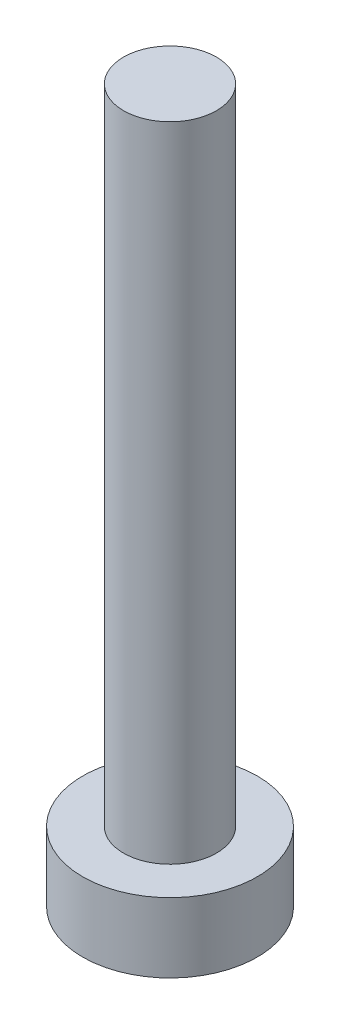
ISO-10303-21;
HEADER;
FILE_DESCRIPTION(('STEP AP214'),'2;1');
FILE_NAME('part.step','',(''),(''),'','','');
FILE_SCHEMA(('AUTOMOTIVE_DESIGN { 1 0 10303 214 1 1 1 1 }'));
ENDSEC;
DATA;
#1=APPLICATION_CONTEXT('core data for automotive mechanical design processes');
#2=APPLICATION_PROTOCOL_DEFINITION('international standard','automotive_design',2000,#1);
#3=PRODUCT_CONTEXT('',#1,'mechanical');
#4=PRODUCT('Part','Part','',(#3));
#5=PRODUCT_RELATED_PRODUCT_CATEGORY('part','',(#4));
#6=PRODUCT_DEFINITION_FORMATION('','',#4);
#7=PRODUCT_DEFINITION_CONTEXT('part definition',#1,'design');
#8=PRODUCT_DEFINITION('design','',#6,#7);
#9=PRODUCT_DEFINITION_SHAPE('','',#8);
#10=(LENGTH_UNIT() NAMED_UNIT(*) SI_UNIT(.MILLI.,.METRE.));
#11=(NAMED_UNIT(*) PLANE_ANGLE_UNIT() SI_UNIT($,.RADIAN.));
#12=(NAMED_UNIT(*) SI_UNIT($,.STERADIAN.) SOLID_ANGLE_UNIT());
#13=UNCERTAINTY_MEASURE_WITH_UNIT(LENGTH_MEASURE(1.E-05),#10,'distance_accuracy_value','');
#14=(GEOMETRIC_REPRESENTATION_CONTEXT(3) GLOBAL_UNCERTAINTY_ASSIGNED_CONTEXT((#13)) GLOBAL_UNIT_ASSIGNED_CONTEXT((#10,
#11,#12)) REPRESENTATION_CONTEXT('',''));
#15=CARTESIAN_POINT('',(0.,0.,0.));
#16=DIRECTION('',(0.,0.,1.));
#17=DIRECTION('',(1.,0.,0.));
#18=AXIS2_PLACEMENT_3D('',#15,#16,#17);
#19=CARTESIAN_POINT('',(0.,18.48,0.));
#20=DIRECTION('',(0.,-1.,0.));
#21=DIRECTION('',(0.,0.,-1.));
#22=AXIS2_PLACEMENT_3D('',#19,#20,#21);
#23=CYLINDRICAL_SURFACE('',#22,1.335);
#24=CARTESIAN_POINT('',(0.,18.48,0.));
#25=DIRECTION('',(0.,1.,0.));
#26=DIRECTION('',(0.,0.,1.));
#27=AXIS2_PLACEMENT_3D('',#24,#25,#26);
#28=CIRCLE('',#27,1.335);
#29=CARTESIAN_POINT('',(0.,18.48,1.335));
#30=VERTEX_POINT('',#29);
#31=EDGE_CURVE('E10',#30,#30,#28,.T.);
#32=ORIENTED_EDGE('',*,*,#31,.F.);
#33=EDGE_LOOP('',(#32));
#34=FACE_BOUND('',#33,.T.);
#35=CARTESIAN_POINT('',(0.,0.,0.));
#36=DIRECTION('',(0.,-1.,0.));
#37=DIRECTION('',(0.,0.,-1.));
#38=AXIS2_PLACEMENT_3D('',#35,#36,#37);
#39=CIRCLE('',#38,1.335);
#40=CARTESIAN_POINT('',(0.,0.,-1.335));
#41=VERTEX_POINT('',#40);
#42=EDGE_CURVE('E36',#41,#41,#39,.T.);
#43=ORIENTED_EDGE('',*,*,#42,.F.);
#44=EDGE_LOOP('',(#43));
#45=FACE_BOUND('',#44,.T.);
#46=ADVANCED_FACE('F30',(#34,#45),#23,.T.);
#47=CARTESIAN_POINT('',(0.,18.48,0.));
#48=DIRECTION('',(0.,1.,0.));
#49=DIRECTION('',(0.,0.,1.));
#50=AXIS2_PLACEMENT_3D('',#47,#48,#49);
#51=PLANE('',#50);
#52=ORIENTED_EDGE('',*,*,#31,.T.);
#53=EDGE_LOOP('',(#52));
#54=FACE_BOUND('',#53,.T.);
#55=ADVANCED_FACE('F63',(#54),#51,.T.);
#56=CARTESIAN_POINT('',(0.,-2.,0.));
#57=DIRECTION('',(0.,1.,0.));
#58=DIRECTION('',(0.,0.,1.));
#59=AXIS2_PLACEMENT_3D('',#56,#57,#58);
#60=CYLINDRICAL_SURFACE('',#59,2.51);
#61=CARTESIAN_POINT('',(0.,-2.,0.));
#62=DIRECTION('',(0.,-1.,0.));
#63=DIRECTION('',(0.,0.,-1.));
#64=AXIS2_PLACEMENT_3D('',#61,#62,#63);
#65=CIRCLE('',#64,2.51);
#66=CARTESIAN_POINT('',(0.,-2.,-2.51));
#67=VERTEX_POINT('',#66);
#68=EDGE_CURVE('E40',#67,#67,#65,.T.);
#69=ORIENTED_EDGE('',*,*,#68,.F.);
#70=EDGE_LOOP('',(#69));
#71=FACE_BOUND('',#70,.T.);
#72=CARTESIAN_POINT('',(0.,0.,0.));
#73=DIRECTION('',(0.,-1.,0.));
#74=DIRECTION('',(0.,0.,-1.));
#75=AXIS2_PLACEMENT_3D('',#72,#73,#74);
#76=CIRCLE('',#75,2.51);
#77=CARTESIAN_POINT('',(0.,0.,-2.51));
#78=VERTEX_POINT('',#77);
#79=EDGE_CURVE('E44',#78,#78,#76,.T.);
#80=ORIENTED_EDGE('',*,*,#79,.T.);
#81=EDGE_LOOP('',(#80));
#82=FACE_BOUND('',#81,.T.);
#83=ADVANCED_FACE('F50',(#71,#82),#60,.T.);
#84=CARTESIAN_POINT('',(0.,-2.,0.));
#85=DIRECTION('',(0.,-1.,0.));
#86=DIRECTION('',(0.,0.,-1.));
#87=AXIS2_PLACEMENT_3D('',#84,#85,#86);
#88=PLANE('',#87);
#89=ORIENTED_EDGE('',*,*,#68,.T.);
#90=EDGE_LOOP('',(#89));
#91=FACE_BOUND('',#90,.T.);
#92=ADVANCED_FACE('F54',(#91),#88,.T.);
#93=CARTESIAN_POINT('',(0.,0.,0.));
#94=DIRECTION('',(0.,-1.,0.));
#95=DIRECTION('',(0.,0.,-1.));
#96=AXIS2_PLACEMENT_3D('',#93,#94,#95);
#97=PLANE('',#96);
#98=ORIENTED_EDGE('',*,*,#42,.T.);
#99=EDGE_LOOP('',(#98));
#100=FACE_BOUND('',#99,.T.);
#101=ORIENTED_EDGE('',*,*,#79,.F.);
#102=EDGE_LOOP('',(#101));
#103=FACE_BOUND('',#102,.T.);
#104=ADVANCED_FACE('F52',(#100,#103),#97,.F.);
#105=CLOSED_SHELL('',(#46,#55,#83,#92,#104));
#106=MANIFOLD_SOLID_BREP('B2',#105);
#107=ADVANCED_BREP_SHAPE_REPRESENTATION('',(#18,#106),#14);
#108=SHAPE_DEFINITION_REPRESENTATION(#9,#107);
ENDSEC;
END-ISO-10303-21;
